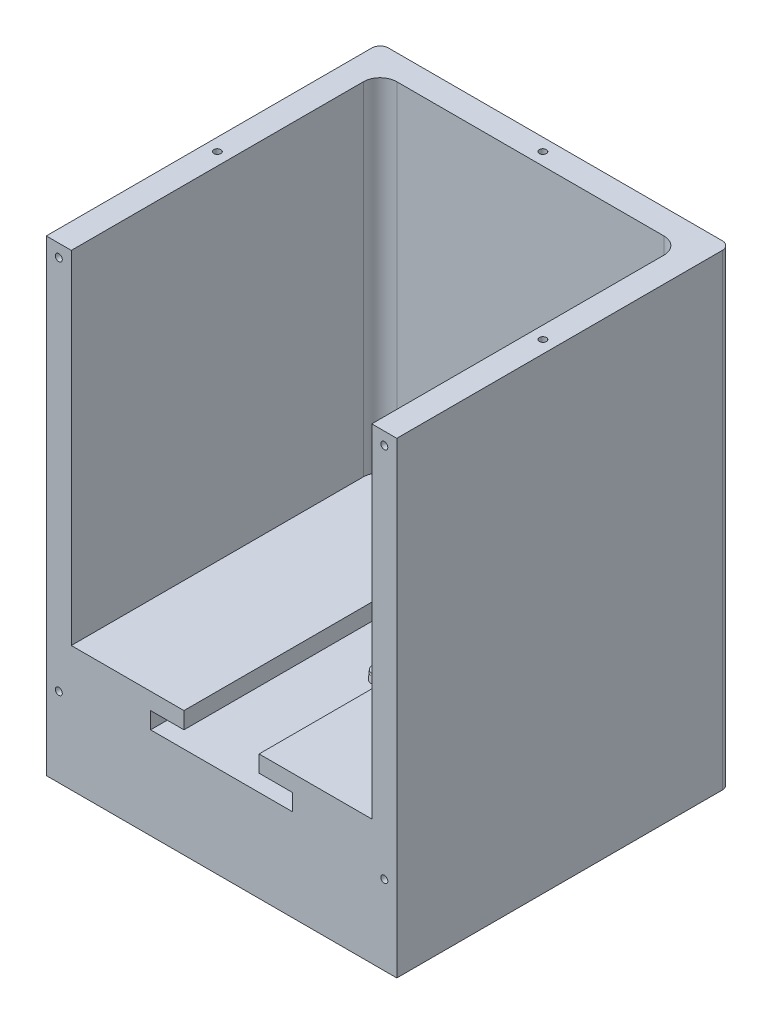
ISO-10303-21;
HEADER;
FILE_DESCRIPTION(('STEP AP214'),'2;1');
FILE_NAME('part.step','',(''),(''),'','','');
FILE_SCHEMA(('AUTOMOTIVE_DESIGN { 1 0 10303 214 1 1 1 1 }'));
ENDSEC;
DATA;
#1=APPLICATION_CONTEXT('core data for automotive mechanical design processes');
#2=APPLICATION_PROTOCOL_DEFINITION('international standard','automotive_design',2000,#1);
#3=PRODUCT_CONTEXT('',#1,'mechanical');
#4=PRODUCT('Part','Part','',(#3));
#5=PRODUCT_RELATED_PRODUCT_CATEGORY('part','',(#4));
#6=PRODUCT_DEFINITION_FORMATION('','',#4);
#7=PRODUCT_DEFINITION_CONTEXT('part definition',#1,'design');
#8=PRODUCT_DEFINITION('design','',#6,#7);
#9=PRODUCT_DEFINITION_SHAPE('','',#8);
#10=(LENGTH_UNIT() NAMED_UNIT(*) SI_UNIT(.MILLI.,.METRE.));
#11=(NAMED_UNIT(*) PLANE_ANGLE_UNIT() SI_UNIT($,.RADIAN.));
#12=(NAMED_UNIT(*) SI_UNIT($,.STERADIAN.) SOLID_ANGLE_UNIT());
#13=UNCERTAINTY_MEASURE_WITH_UNIT(LENGTH_MEASURE(1.E-05),#10,'distance_accuracy_value','');
#14=(GEOMETRIC_REPRESENTATION_CONTEXT(3) GLOBAL_UNCERTAINTY_ASSIGNED_CONTEXT((#13)) GLOBAL_UNIT_ASSIGNED_CONTEXT((#10,
#11,#12)) REPRESENTATION_CONTEXT('',''));
#15=CARTESIAN_POINT('',(0.,0.,0.));
#16=DIRECTION('',(0.,0.,1.));
#17=DIRECTION('',(1.,0.,0.));
#18=AXIS2_PLACEMENT_3D('',#15,#16,#17);
#19=CARTESIAN_POINT('',(-105.,225.,-15.));
#20=DIRECTION('',(0.,0.,1.));
#21=DIRECTION('',(1.,0.,0.));
#22=AXIS2_PLACEMENT_3D('',#19,#20,#21);
#23=PLANE('',#22);
#24=DIRECTION('',(1.,0.,0.));
#25=VECTOR('',#24,1.);
#26=CARTESIAN_POINT('',(0.,-55.,-15.));
#27=LINE('',#26,#25);
#28=CARTESIAN_POINT('',(-99.9999999999999,-55.,-15.));
#29=VERTEX_POINT('',#28);
#30=CARTESIAN_POINT('',(99.9999999999999,-55.,-15.));
#31=VERTEX_POINT('',#30);
#32=EDGE_CURVE('E290',#29,#31,#27,.T.);
#33=ORIENTED_EDGE('',*,*,#32,.F.);
#34=DIRECTION('',(0.,-1.,0.));
#35=VECTOR('',#34,1.);
#36=CARTESIAN_POINT('',(-99.9999999999999,225.,-15.));
#37=LINE('',#36,#35);
#38=CARTESIAN_POINT('',(-99.9999999999999,225.,-15.));
#39=VERTEX_POINT('',#38);
#40=EDGE_CURVE('E71',#29,#39,#37,.F.);
#41=ORIENTED_EDGE('',*,*,#40,.T.);
#42=DIRECTION('',(-1.,0.,0.));
#43=VECTOR('',#42,1.);
#44=CARTESIAN_POINT('',(-105.,225.,-15.));
#45=LINE('',#44,#43);
#46=CARTESIAN_POINT('',(99.9999999999999,225.,-15.));
#47=VERTEX_POINT('',#46);
#48=EDGE_CURVE('E415',#47,#39,#45,.T.);
#49=ORIENTED_EDGE('',*,*,#48,.F.);
#50=DIRECTION('',(0.,-1.,0.));
#51=VECTOR('',#50,1.);
#52=CARTESIAN_POINT('',(99.9999999999999,225.,-15.));
#53=LINE('',#52,#51);
#54=EDGE_CURVE('E482',#47,#31,#53,.T.);
#55=ORIENTED_EDGE('',*,*,#54,.T.);
#56=EDGE_LOOP('',(#33,#41,#49,#55));
#57=FACE_BOUND('',#56,.T.);
#58=DIRECTION('',(-1.,0.,0.));
#59=VECTOR('',#58,1.);
#60=CARTESIAN_POINT('',(0.,10.25,-15.));
#61=LINE('',#60,#59);
#62=CARTESIAN_POINT('',(42.5,10.25,-15.));
#63=VERTEX_POINT('',#62);
#64=CARTESIAN_POINT('',(21.5,10.25,-15.));
#65=VERTEX_POINT('',#64);
#66=EDGE_CURVE('E216',#63,#65,#61,.T.);
#67=ORIENTED_EDGE('',*,*,#66,.T.);
#68=DIRECTION('',(0.,-1.,0.));
#69=VECTOR('',#68,1.);
#70=CARTESIAN_POINT('',(21.5,0.,-15.));
#71=LINE('',#70,#69);
#72=CARTESIAN_POINT('',(21.5,0.,-15.));
#73=VERTEX_POINT('',#72);
#74=EDGE_CURVE('E227',#65,#73,#71,.T.);
#75=ORIENTED_EDGE('',*,*,#74,.T.);
#76=DIRECTION('',(-1.,0.,0.));
#77=VECTOR('',#76,1.);
#78=CARTESIAN_POINT('',(0.,0.,-15.));
#79=LINE('',#78,#77);
#80=CARTESIAN_POINT('',(42.5,0.,-15.));
#81=VERTEX_POINT('',#80);
#82=EDGE_CURVE('E223',#81,#73,#79,.T.);
#83=ORIENTED_EDGE('',*,*,#82,.F.);
#84=DIRECTION('',(0.,-1.,0.));
#85=VECTOR('',#84,1.);
#86=CARTESIAN_POINT('',(42.5,0.,-15.));
#87=LINE('',#86,#85);
#88=EDGE_CURVE('E237',#63,#81,#87,.T.);
#89=ORIENTED_EDGE('',*,*,#88,.F.);
#90=EDGE_LOOP('',(#67,#75,#83,#89));
#91=FACE_BOUND('',#90,.T.);
#92=ADVANCED_FACE('F49',(#57,#91),#23,.F.);
#93=CARTESIAN_POINT('',(-90.,225.,185.));
#94=DIRECTION('',(0.,0.,-1.));
#95=DIRECTION('',(-1.,0.,0.));
#96=AXIS2_PLACEMENT_3D('',#93,#94,#95);
#97=PLANE('',#96);
#98=DIRECTION('',(0.,-1.,0.));
#99=VECTOR('',#98,1.);
#100=CARTESIAN_POINT('',(-42.5,10.,185.));
#101=LINE('',#100,#99);
#102=CARTESIAN_POINT('',(-42.5,10.,185.));
#103=VERTEX_POINT('',#102);
#104=CARTESIAN_POINT('',(-42.5,0.,185.));
#105=VERTEX_POINT('',#104);
#106=EDGE_CURVE('E264',#103,#105,#101,.T.);
#107=ORIENTED_EDGE('',*,*,#106,.F.);
#108=DIRECTION('',(1.,0.,0.));
#109=VECTOR('',#108,1.);
#110=CARTESIAN_POINT('',(-90.,10.,185.));
#111=LINE('',#110,#109);
#112=CARTESIAN_POINT('',(-22.5,10.,185.));
#113=VERTEX_POINT('',#112);
#114=EDGE_CURVE('E333',#103,#113,#111,.T.);
#115=ORIENTED_EDGE('',*,*,#114,.T.);
#116=DIRECTION('',(0.,-1.,0.));
#117=VECTOR('',#116,1.);
#118=CARTESIAN_POINT('',(-22.5,20.,185.));
#119=LINE('',#118,#117);
#120=CARTESIAN_POINT('',(-22.5,20.,185.));
#121=VERTEX_POINT('',#120);
#122=EDGE_CURVE('E393',#121,#113,#119,.T.);
#123=ORIENTED_EDGE('',*,*,#122,.F.);
#124=DIRECTION('',(1.,0.,0.));
#125=VECTOR('',#124,1.);
#126=CARTESIAN_POINT('',(-90.,20.,185.));
#127=LINE('',#126,#125);
#128=CARTESIAN_POINT('',(-90.,20.,185.));
#129=VERTEX_POINT('',#128);
#130=EDGE_CURVE('E337',#129,#121,#127,.T.);
#131=ORIENTED_EDGE('',*,*,#130,.F.);
#132=DIRECTION('',(0.,-1.,0.));
#133=VECTOR('',#132,1.);
#134=CARTESIAN_POINT('',(-90.,225.,185.));
#135=LINE('',#134,#133);
#136=CARTESIAN_POINT('',(-90.,225.,185.));
#137=VERTEX_POINT('',#136);
#138=EDGE_CURVE('E424',#137,#129,#135,.T.);
#139=ORIENTED_EDGE('',*,*,#138,.F.);
#140=DIRECTION('',(1.,0.,0.));
#141=VECTOR('',#140,1.);
#142=CARTESIAN_POINT('',(-90.,225.,185.));
#143=LINE('',#142,#141);
#144=CARTESIAN_POINT('',(-105.,225.,185.));
#145=VERTEX_POINT('',#144);
#146=EDGE_CURVE('E421',#145,#137,#143,.T.);
#147=ORIENTED_EDGE('',*,*,#146,.F.);
#148=DIRECTION('',(0.,-1.,0.));
#149=VECTOR('',#148,1.);
#150=CARTESIAN_POINT('',(-105.,225.,185.));
#151=LINE('',#150,#149);
#152=CARTESIAN_POINT('',(-105.,-55.,185.));
#153=VERTEX_POINT('',#152);
#154=EDGE_CURVE('E431',#145,#153,#151,.T.);
#155=ORIENTED_EDGE('',*,*,#154,.T.);
#156=DIRECTION('',(-1.,0.,0.));
#157=VECTOR('',#156,1.);
#158=CARTESIAN_POINT('',(0.,-55.,185.));
#159=LINE('',#158,#157);
#160=CARTESIAN_POINT('',(105.,-55.,185.));
#161=VERTEX_POINT('',#160);
#162=EDGE_CURVE('E282',#161,#153,#159,.T.);
#163=ORIENTED_EDGE('',*,*,#162,.F.);
#164=DIRECTION('',(0.,-1.,0.));
#165=VECTOR('',#164,1.);
#166=CARTESIAN_POINT('',(105.,225.,185.));
#167=LINE('',#166,#165);
#168=CARTESIAN_POINT('',(105.,225.,185.));
#169=VERTEX_POINT('',#168);
#170=EDGE_CURVE('E434',#169,#161,#167,.T.);
#171=ORIENTED_EDGE('',*,*,#170,.F.);
#172=DIRECTION('',(1.,0.,0.));
#173=VECTOR('',#172,1.);
#174=CARTESIAN_POINT('',(105.,225.,185.));
#175=LINE('',#174,#173);
#176=CARTESIAN_POINT('',(90.,225.,185.));
#177=VERTEX_POINT('',#176);
#178=EDGE_CURVE('E409',#177,#169,#175,.T.);
#179=ORIENTED_EDGE('',*,*,#178,.F.);
#180=DIRECTION('',(0.,-1.,0.));
#181=VECTOR('',#180,1.);
#182=CARTESIAN_POINT('',(90.,225.,185.));
#183=LINE('',#182,#181);
#184=CARTESIAN_POINT('',(90.,20.,185.));
#185=VERTEX_POINT('',#184);
#186=EDGE_CURVE('E438',#177,#185,#183,.T.);
#187=ORIENTED_EDGE('',*,*,#186,.T.);
#188=DIRECTION('',(1.,0.,0.));
#189=VECTOR('',#188,1.);
#190=CARTESIAN_POINT('',(22.5,20.,185.));
#191=LINE('',#190,#189);
#192=CARTESIAN_POINT('',(22.5,20.,185.));
#193=VERTEX_POINT('',#192);
#194=EDGE_CURVE('E350',#193,#185,#191,.T.);
#195=ORIENTED_EDGE('',*,*,#194,.F.);
#196=DIRECTION('',(0.,-1.,0.));
#197=VECTOR('',#196,1.);
#198=CARTESIAN_POINT('',(22.5,20.,185.));
#199=LINE('',#198,#197);
#200=CARTESIAN_POINT('',(22.5,10.,185.));
#201=VERTEX_POINT('',#200);
#202=EDGE_CURVE('E362',#193,#201,#199,.T.);
#203=ORIENTED_EDGE('',*,*,#202,.T.);
#204=DIRECTION('',(1.,0.,0.));
#205=VECTOR('',#204,1.);
#206=CARTESIAN_POINT('',(22.5,10.,185.));
#207=LINE('',#206,#205);
#208=CARTESIAN_POINT('',(42.5,10.,185.));
#209=VERTEX_POINT('',#208);
#210=EDGE_CURVE('E374',#201,#209,#207,.T.);
#211=ORIENTED_EDGE('',*,*,#210,.T.);
#212=DIRECTION('',(0.,1.,0.));
#213=VECTOR('',#212,1.);
#214=CARTESIAN_POINT('',(42.5,0.,185.));
#215=LINE('',#214,#213);
#216=CARTESIAN_POINT('',(42.5,0.,185.));
#217=VERTEX_POINT('',#216);
#218=EDGE_CURVE('E271',#217,#209,#215,.T.);
#219=ORIENTED_EDGE('',*,*,#218,.F.);
#220=DIRECTION('',(-1.,0.,0.));
#221=VECTOR('',#220,1.);
#222=CARTESIAN_POINT('',(-105.,0.,185.));
#223=LINE('',#222,#221);
#224=EDGE_CURVE('E326',#217,#105,#223,.T.);
#225=ORIENTED_EDGE('',*,*,#224,.T.);
#226=EDGE_LOOP('',(#107,#115,#123,#131,#139,#147,#155,#163,#171,#179,#187,#195,#203,#211,#219,#225));
#227=FACE_BOUND('',#226,.T.);
#228=CARTESIAN_POINT('',(-97.4999999999999,217.5,185.));
#229=DIRECTION('',(0.,0.,1.));
#230=DIRECTION('',(1.,0.,0.));
#231=AXIS2_PLACEMENT_3D('',#228,#229,#230);
#232=CIRCLE('',#231,2.1);
#233=CARTESIAN_POINT('',(-95.3999999999999,217.5,185.));
#234=VERTEX_POINT('',#233);
#235=EDGE_CURVE('E307',#234,#234,#232,.T.);
#236=ORIENTED_EDGE('',*,*,#235,.F.);
#237=EDGE_LOOP('',(#236));
#238=FACE_BOUND('',#237,.T.);
#239=CARTESIAN_POINT('',(-97.4999999999999,-7.50000000000001,185.));
#240=DIRECTION('',(0.,0.,1.));
#241=DIRECTION('',(1.,0.,0.));
#242=AXIS2_PLACEMENT_3D('',#239,#240,#241);
#243=CIRCLE('',#242,2.1);
#244=CARTESIAN_POINT('',(-95.3999999999999,-7.50000000000001,185.));
#245=VERTEX_POINT('',#244);
#246=EDGE_CURVE('E302',#245,#245,#243,.T.);
#247=ORIENTED_EDGE('',*,*,#246,.F.);
#248=EDGE_LOOP('',(#247));
#249=FACE_BOUND('',#248,.T.);
#250=CARTESIAN_POINT('',(97.4999999999999,217.5,185.));
#251=DIRECTION('',(0.,0.,-1.));
#252=DIRECTION('',(-1.,0.,0.));
#253=AXIS2_PLACEMENT_3D('',#250,#251,#252);
#254=CIRCLE('',#253,2.1);
#255=CARTESIAN_POINT('',(95.3999999999999,217.5,185.));
#256=VERTEX_POINT('',#255);
#257=EDGE_CURVE('E298',#256,#256,#254,.T.);
#258=ORIENTED_EDGE('',*,*,#257,.T.);
#259=EDGE_LOOP('',(#258));
#260=FACE_BOUND('',#259,.T.);
#261=CARTESIAN_POINT('',(97.4999999999999,-7.50000000000001,185.));
#262=DIRECTION('',(0.,0.,-1.));
#263=DIRECTION('',(-1.,0.,0.));
#264=AXIS2_PLACEMENT_3D('',#261,#262,#263);
#265=CIRCLE('',#264,2.1);
#266=CARTESIAN_POINT('',(95.3999999999999,-7.50000000000001,185.));
#267=VERTEX_POINT('',#266);
#268=EDGE_CURVE('E315',#267,#267,#265,.T.);
#269=ORIENTED_EDGE('',*,*,#268,.T.);
#270=EDGE_LOOP('',(#269));
#271=FACE_BOUND('',#270,.T.);
#272=ADVANCED_FACE('F514',(#227,#238,#249,#260,#271),#97,.F.);
#273=CARTESIAN_POINT('',(-90.,225.,0.));
#274=DIRECTION('',(-1.,0.,0.));
#275=DIRECTION('',(0.,0.,1.));
#276=AXIS2_PLACEMENT_3D('',#273,#274,#275);
#277=PLANE('',#276);
#278=DIRECTION('',(0.,0.,1.));
#279=VECTOR('',#278,1.);
#280=CARTESIAN_POINT('',(-90.,20.,185.));
#281=LINE('',#280,#279);
#282=CARTESIAN_POINT('',(-90.,20.,10.));
#283=VERTEX_POINT('',#282);
#284=EDGE_CURVE('E334',#283,#129,#281,.T.);
#285=ORIENTED_EDGE('',*,*,#284,.F.);
#286=DIRECTION('',(0.,-1.,0.));
#287=VECTOR('',#286,1.);
#288=CARTESIAN_POINT('',(-90.,225.,10.));
#289=LINE('',#288,#287);
#290=CARTESIAN_POINT('',(-90.,225.,10.));
#291=VERTEX_POINT('',#290);
#292=EDGE_CURVE('E459',#283,#291,#289,.F.);
#293=ORIENTED_EDGE('',*,*,#292,.T.);
#294=DIRECTION('',(0.,0.,-1.));
#295=VECTOR('',#294,1.);
#296=CARTESIAN_POINT('',(-90.,225.,0.));
#297=LINE('',#296,#295);
#298=EDGE_CURVE('E398',#137,#291,#297,.T.);
#299=ORIENTED_EDGE('',*,*,#298,.F.);
#300=ORIENTED_EDGE('',*,*,#138,.T.);
#301=EDGE_LOOP('',(#285,#293,#299,#300));
#302=FACE_BOUND('',#301,.T.);
#303=ADVANCED_FACE('F641',(#302),#277,.F.);
#304=CARTESIAN_POINT('',(-90.,225.,0.));
#305=DIRECTION('',(0.,0.,-1.));
#306=DIRECTION('',(-1.,0.,0.));
#307=AXIS2_PLACEMENT_3D('',#304,#305,#306);
#308=PLANE('',#307);
#309=DIRECTION('',(1.,0.,0.));
#310=VECTOR('',#309,1.);
#311=CARTESIAN_POINT('',(-90.,225.,0.));
#312=LINE('',#311,#310);
#313=CARTESIAN_POINT('',(-80.,225.,0.));
#314=VERTEX_POINT('',#313);
#315=CARTESIAN_POINT('',(79.9999999999999,225.,0.));
#316=VERTEX_POINT('',#315);
#317=EDGE_CURVE('E402',#314,#316,#312,.T.);
#318=ORIENTED_EDGE('',*,*,#317,.F.);
#319=DIRECTION('',(0.,-1.,0.));
#320=VECTOR('',#319,1.);
#321=CARTESIAN_POINT('',(-80.,20.,0.));
#322=LINE('',#321,#320);
#323=CARTESIAN_POINT('',(-80.,20.,0.));
#324=VERTEX_POINT('',#323);
#325=EDGE_CURVE('E449',#314,#324,#322,.T.);
#326=ORIENTED_EDGE('',*,*,#325,.T.);
#327=DIRECTION('',(-1.,0.,0.));
#328=VECTOR('',#327,1.);
#329=CARTESIAN_POINT('',(-90.,20.,0.));
#330=LINE('',#329,#328);
#331=CARTESIAN_POINT('',(79.9999999999999,20.,0.));
#332=VERTEX_POINT('',#331);
#333=EDGE_CURVE('E358',#332,#324,#330,.T.);
#334=ORIENTED_EDGE('',*,*,#333,.F.);
#335=DIRECTION('',(0.,-1.,0.));
#336=VECTOR('',#335,1.);
#337=CARTESIAN_POINT('',(80.,225.,0.));
#338=LINE('',#337,#336);
#339=EDGE_CURVE('E446',#332,#316,#338,.F.);
#340=ORIENTED_EDGE('',*,*,#339,.T.);
#341=EDGE_LOOP('',(#318,#326,#334,#340));
#342=FACE_BOUND('',#341,.T.);
#343=ADVANCED_FACE('F528',(#342),#308,.F.);
#344=CARTESIAN_POINT('',(90.,225.,0.));
#345=DIRECTION('',(1.,0.,0.));
#346=DIRECTION('',(0.,0.,-1.));
#347=AXIS2_PLACEMENT_3D('',#344,#345,#346);
#348=PLANE('',#347);
#349=DIRECTION('',(0.,0.,1.));
#350=VECTOR('',#349,1.);
#351=CARTESIAN_POINT('',(90.,225.,0.));
#352=LINE('',#351,#350);
#353=CARTESIAN_POINT('',(90.,225.,10.));
#354=VERTEX_POINT('',#353);
#355=EDGE_CURVE('E406',#354,#177,#352,.T.);
#356=ORIENTED_EDGE('',*,*,#355,.F.);
#357=DIRECTION('',(0.,-1.,0.));
#358=VECTOR('',#357,1.);
#359=CARTESIAN_POINT('',(90.,20.,10.));
#360=LINE('',#359,#358);
#361=CARTESIAN_POINT('',(90.,20.,10.));
#362=VERTEX_POINT('',#361);
#363=EDGE_CURVE('E462',#354,#362,#360,.T.);
#364=ORIENTED_EDGE('',*,*,#363,.T.);
#365=DIRECTION('',(0.,0.,-1.));
#366=VECTOR('',#365,1.);
#367=CARTESIAN_POINT('',(90.,20.,0.));
#368=LINE('',#367,#366);
#369=EDGE_CURVE('E354',#185,#362,#368,.T.);
#370=ORIENTED_EDGE('',*,*,#369,.F.);
#371=ORIENTED_EDGE('',*,*,#186,.F.);
#372=EDGE_LOOP('',(#356,#364,#370,#371));
#373=FACE_BOUND('',#372,.T.);
#374=ADVANCED_FACE('F539',(#373),#348,.F.);
#375=DIRECTION('',(1.,0.,0.));
#376=VECTOR('',#375,1.);
#377=CARTESIAN_POINT('',(-90.,0.,0.));
#378=LINE('',#377,#376);
#379=CARTESIAN_POINT('',(-42.5,0.,0.));
#380=VERTEX_POINT('',#379);
#381=CARTESIAN_POINT('',(21.5,0.,0.));
#382=VERTEX_POINT('',#381);
#383=EDGE_CURVE('E397',#380,#382,#378,.T.);
#384=ORIENTED_EDGE('',*,*,#383,.T.);
#385=DIRECTION('',(0.,1.,0.));
#386=VECTOR('',#385,1.);
#387=CARTESIAN_POINT('',(21.5,0.,0.));
#388=LINE('',#387,#386);
#389=CARTESIAN_POINT('',(21.4999999999999,10.,0.));
#390=VERTEX_POINT('',#389);
#391=EDGE_CURVE('E257',#382,#390,#388,.T.);
#392=ORIENTED_EDGE('',*,*,#391,.T.);
#393=DIRECTION('',(-1.,0.,0.));
#394=VECTOR('',#393,1.);
#395=CARTESIAN_POINT('',(-90.,10.,0.));
#396=LINE('',#395,#394);
#397=CARTESIAN_POINT('',(-42.5,10.,0.));
#398=VERTEX_POINT('',#397);
#399=EDGE_CURVE('E378',#390,#398,#396,.T.);
#400=ORIENTED_EDGE('',*,*,#399,.T.);
#401=DIRECTION('',(0.,1.,0.));
#402=VECTOR('',#401,1.);
#403=CARTESIAN_POINT('',(-42.5,0.,0.));
#404=LINE('',#403,#402);
#405=EDGE_CURVE('E256',#380,#398,#404,.T.);
#406=ORIENTED_EDGE('',*,*,#405,.F.);
#407=EDGE_LOOP('',(#384,#392,#400,#406));
#408=FACE_BOUND('',#407,.T.);
#409=ADVANCED_FACE('F569',(#408),#308,.F.);
#410=CARTESIAN_POINT('',(105.,225.,-15.));
#411=DIRECTION('',(-1.,0.,0.));
#412=DIRECTION('',(0.,0.,1.));
#413=AXIS2_PLACEMENT_3D('',#410,#411,#412);
#414=PLANE('',#413);
#415=DIRECTION('',(0.,0.,1.));
#416=VECTOR('',#415,1.);
#417=CARTESIAN_POINT('',(105.,-55.,0.));
#418=LINE('',#417,#416);
#419=CARTESIAN_POINT('',(105.,-55.,-9.99999999999998));
#420=VERTEX_POINT('',#419);
#421=EDGE_CURVE('E294',#420,#161,#418,.T.);
#422=ORIENTED_EDGE('',*,*,#421,.F.);
#423=DIRECTION('',(0.,-1.,0.));
#424=VECTOR('',#423,1.);
#425=CARTESIAN_POINT('',(105.,225.,-9.99999999999998));
#426=LINE('',#425,#424);
#427=CARTESIAN_POINT('',(105.,225.,-9.99999999999999));
#428=VERTEX_POINT('',#427);
#429=EDGE_CURVE('E11',#420,#428,#426,.F.);
#430=ORIENTED_EDGE('',*,*,#429,.T.);
#431=DIRECTION('',(0.,0.,-1.));
#432=VECTOR('',#431,1.);
#433=CARTESIAN_POINT('',(105.,225.,-15.));
#434=LINE('',#433,#432);
#435=EDGE_CURVE('E412',#169,#428,#434,.T.);
#436=ORIENTED_EDGE('',*,*,#435,.F.);
#437=ORIENTED_EDGE('',*,*,#170,.T.);
#438=EDGE_LOOP('',(#422,#430,#436,#437));
#439=FACE_BOUND('',#438,.T.);
#440=ADVANCED_FACE('F508',(#439),#414,.F.);
#441=CARTESIAN_POINT('',(-105.,225.,185.));
#442=DIRECTION('',(1.,0.,0.));
#443=DIRECTION('',(0.,0.,-1.));
#444=AXIS2_PLACEMENT_3D('',#441,#442,#443);
#445=PLANE('',#444);
#446=DIRECTION('',(0.,0.,1.));
#447=VECTOR('',#446,1.);
#448=CARTESIAN_POINT('',(-105.,225.,185.));
#449=LINE('',#448,#447);
#450=CARTESIAN_POINT('',(-105.,225.,-9.99999999999993));
#451=VERTEX_POINT('',#450);
#452=EDGE_CURVE('E418',#451,#145,#449,.T.);
#453=ORIENTED_EDGE('',*,*,#452,.F.);
#454=DIRECTION('',(0.,-1.,0.));
#455=VECTOR('',#454,1.);
#456=CARTESIAN_POINT('',(-105.,225.,-9.99999999999998));
#457=LINE('',#456,#455);
#458=CARTESIAN_POINT('',(-105.,-55.,-9.99999999999998));
#459=VERTEX_POINT('',#458);
#460=EDGE_CURVE('E472',#451,#459,#457,.T.);
#461=ORIENTED_EDGE('',*,*,#460,.T.);
#462=DIRECTION('',(0.,0.,-1.));
#463=VECTOR('',#462,1.);
#464=CARTESIAN_POINT('',(-105.,-55.,0.));
#465=LINE('',#464,#463);
#466=EDGE_CURVE('E286',#153,#459,#465,.T.);
#467=ORIENTED_EDGE('',*,*,#466,.F.);
#468=ORIENTED_EDGE('',*,*,#154,.F.);
#469=EDGE_LOOP('',(#453,#461,#467,#468));
#470=FACE_BOUND('',#469,.T.);
#471=ADVANCED_FACE('F499',(#470),#445,.F.);
#472=CARTESIAN_POINT('',(0.,225.,0.));
#473=DIRECTION('',(0.,-1.,0.));
#474=DIRECTION('',(0.,0.,-1.));
#475=AXIS2_PLACEMENT_3D('',#472,#473,#474);
#476=PLANE('',#475);
#477=CARTESIAN_POINT('',(0.,225.,-7.50000000000006));
#478=DIRECTION('',(0.,1.,0.));
#479=DIRECTION('',(0.,0.,1.));
#480=AXIS2_PLACEMENT_3D('',#477,#478,#479);
#481=CIRCLE('',#480,2.1);
#482=CARTESIAN_POINT('',(0.,225.,-5.40000000000006));
#483=VERTEX_POINT('',#482);
#484=EDGE_CURVE('E594',#483,#483,#481,.T.);
#485=ORIENTED_EDGE('',*,*,#484,.F.);
#486=EDGE_LOOP('',(#485));
#487=FACE_BOUND('',#486,.T.);
#488=CARTESIAN_POINT('',(-97.4999999999999,225.,90.));
#489=DIRECTION('',(0.,1.,0.));
#490=DIRECTION('',(0.,0.,1.));
#491=AXIS2_PLACEMENT_3D('',#488,#489,#490);
#492=CIRCLE('',#491,2.1);
#493=CARTESIAN_POINT('',(-97.4999999999999,225.,92.1));
#494=VERTEX_POINT('',#493);
#495=EDGE_CURVE('E590',#494,#494,#492,.T.);
#496=ORIENTED_EDGE('',*,*,#495,.F.);
#497=EDGE_LOOP('',(#496));
#498=FACE_BOUND('',#497,.T.);
#499=CARTESIAN_POINT('',(97.4999999999999,225.,90.));
#500=DIRECTION('',(0.,1.,0.));
#501=DIRECTION('',(0.,0.,-1.));
#502=AXIS2_PLACEMENT_3D('',#499,#500,#501);
#503=CIRCLE('',#502,2.09999999999987);
#504=CARTESIAN_POINT('',(97.4999999999999,225.,87.9000000000001));
#505=VERTEX_POINT('',#504);
#506=EDGE_CURVE('E582',#505,#505,#503,.T.);
#507=ORIENTED_EDGE('',*,*,#506,.F.);
#508=EDGE_LOOP('',(#507));
#509=FACE_BOUND('',#508,.T.);
#510=ORIENTED_EDGE('',*,*,#48,.T.);
#511=CARTESIAN_POINT('',(-99.9999999999999,225.,-9.99999999999998));
#512=DIRECTION('',(0.,-1.,0.));
#513=DIRECTION('',(0.,0.,-1.));
#514=AXIS2_PLACEMENT_3D('',#511,#512,#513);
#515=CIRCLE('',#514,5.);
#516=EDGE_CURVE('E58',#39,#451,#515,.F.);
#517=ORIENTED_EDGE('',*,*,#516,.T.);
#518=ORIENTED_EDGE('',*,*,#452,.T.);
#519=ORIENTED_EDGE('',*,*,#146,.T.);
#520=ORIENTED_EDGE('',*,*,#298,.T.);
#521=CARTESIAN_POINT('',(-80.,225.,10.));
#522=DIRECTION('',(0.,-1.,0.));
#523=DIRECTION('',(0.,0.,-1.));
#524=AXIS2_PLACEMENT_3D('',#521,#522,#523);
#525=CIRCLE('',#524,10.);
#526=EDGE_CURVE('E466',#291,#314,#525,.T.);
#527=ORIENTED_EDGE('',*,*,#526,.T.);
#528=ORIENTED_EDGE('',*,*,#317,.T.);
#529=CARTESIAN_POINT('',(80.,225.,10.));
#530=DIRECTION('',(0.,-1.,0.));
#531=DIRECTION('',(0.,0.,-1.));
#532=AXIS2_PLACEMENT_3D('',#529,#530,#531);
#533=CIRCLE('',#532,10.);
#534=EDGE_CURVE('E469',#316,#354,#533,.T.);
#535=ORIENTED_EDGE('',*,*,#534,.T.);
#536=ORIENTED_EDGE('',*,*,#355,.T.);
#537=ORIENTED_EDGE('',*,*,#178,.T.);
#538=ORIENTED_EDGE('',*,*,#435,.T.);
#539=CARTESIAN_POINT('',(99.9999999999999,225.,-9.99999999999998));
#540=DIRECTION('',(0.,-1.,0.));
#541=DIRECTION('',(0.,0.,-1.));
#542=AXIS2_PLACEMENT_3D('',#539,#540,#541);
#543=CIRCLE('',#542,5.);
#544=EDGE_CURVE('E488',#428,#47,#543,.F.);
#545=ORIENTED_EDGE('',*,*,#544,.T.);
#546=EDGE_LOOP('',(#510,#517,#518,#519,#520,#527,#528,#535,#536,#537,#538,#545));
#547=FACE_BOUND('',#546,.T.);
#548=ADVANCED_FACE('F494',(#487,#498,#509,#547),#476,.F.);
#549=CARTESIAN_POINT('',(-22.5,20.,185.));
#550=DIRECTION('',(-1.,0.,0.));
#551=DIRECTION('',(0.,0.,1.));
#552=AXIS2_PLACEMENT_3D('',#549,#550,#551);
#553=PLANE('',#552);
#554=DIRECTION('',(0.,0.,-1.));
#555=VECTOR('',#554,1.);
#556=CARTESIAN_POINT('',(-22.5,10.,185.));
#557=LINE('',#556,#555);
#558=CARTESIAN_POINT('',(-22.5,10.,10.));
#559=VERTEX_POINT('',#558);
#560=EDGE_CURVE('E365',#113,#559,#557,.T.);
#561=ORIENTED_EDGE('',*,*,#560,.T.);
#562=DIRECTION('',(0.,-1.,0.));
#563=VECTOR('',#562,1.);
#564=CARTESIAN_POINT('',(-22.5,20.,10.));
#565=LINE('',#564,#563);
#566=CARTESIAN_POINT('',(-22.5,20.,10.));
#567=VERTEX_POINT('',#566);
#568=EDGE_CURVE('E389',#567,#559,#565,.T.);
#569=ORIENTED_EDGE('',*,*,#568,.F.);
#570=DIRECTION('',(0.,0.,-1.));
#571=VECTOR('',#570,1.);
#572=CARTESIAN_POINT('',(-22.5,20.,185.));
#573=LINE('',#572,#571);
#574=EDGE_CURVE('E341',#121,#567,#573,.T.);
#575=ORIENTED_EDGE('',*,*,#574,.F.);
#576=ORIENTED_EDGE('',*,*,#122,.T.);
#577=EDGE_LOOP('',(#561,#569,#575,#576));
#578=FACE_BOUND('',#577,.T.);
#579=ADVANCED_FACE('F613',(#578),#553,.F.);
#580=CARTESIAN_POINT('',(-22.5,20.,10.));
#581=DIRECTION('',(0.,0.,-1.));
#582=DIRECTION('',(-1.,0.,0.));
#583=AXIS2_PLACEMENT_3D('',#580,#581,#582);
#584=PLANE('',#583);
#585=DIRECTION('',(1.,0.,0.));
#586=VECTOR('',#585,1.);
#587=CARTESIAN_POINT('',(-22.5,10.,10.));
#588=LINE('',#587,#586);
#589=CARTESIAN_POINT('',(22.4999999999999,10.,10.));
#590=VERTEX_POINT('',#589);
#591=EDGE_CURVE('E368',#559,#590,#588,.T.);
#592=ORIENTED_EDGE('',*,*,#591,.T.);
#593=DIRECTION('',(0.,-1.,0.));
#594=VECTOR('',#593,1.);
#595=CARTESIAN_POINT('',(22.4999999999999,20.,10.));
#596=LINE('',#595,#594);
#597=CARTESIAN_POINT('',(22.4999999999999,20.,10.));
#598=VERTEX_POINT('',#597);
#599=EDGE_CURVE('E385',#598,#590,#596,.T.);
#600=ORIENTED_EDGE('',*,*,#599,.F.);
#601=DIRECTION('',(1.,0.,0.));
#602=VECTOR('',#601,1.);
#603=CARTESIAN_POINT('',(-22.5,20.,10.));
#604=LINE('',#603,#602);
#605=EDGE_CURVE('E344',#567,#598,#604,.T.);
#606=ORIENTED_EDGE('',*,*,#605,.F.);
#607=ORIENTED_EDGE('',*,*,#568,.T.);
#608=EDGE_LOOP('',(#592,#600,#606,#607));
#609=FACE_BOUND('',#608,.T.);
#610=ADVANCED_FACE('F913',(#609),#584,.F.);
#611=CARTESIAN_POINT('',(22.4999999999999,20.,10.));
#612=DIRECTION('',(1.,0.,0.));
#613=DIRECTION('',(0.,0.,-1.));
#614=AXIS2_PLACEMENT_3D('',#611,#612,#613);
#615=PLANE('',#614);
#616=DIRECTION('',(0.,0.,1.));
#617=VECTOR('',#616,1.);
#618=CARTESIAN_POINT('',(22.4999999999999,10.,10.));
#619=LINE('',#618,#617);
#620=EDGE_CURVE('E371',#590,#201,#619,.T.);
#621=ORIENTED_EDGE('',*,*,#620,.T.);
#622=ORIENTED_EDGE('',*,*,#202,.F.);
#623=DIRECTION('',(0.,0.,1.));
#624=VECTOR('',#623,1.);
#625=CARTESIAN_POINT('',(22.4999999999999,20.,10.));
#626=LINE('',#625,#624);
#627=EDGE_CURVE('E347',#598,#193,#626,.T.);
#628=ORIENTED_EDGE('',*,*,#627,.F.);
#629=ORIENTED_EDGE('',*,*,#599,.T.);
#630=EDGE_LOOP('',(#621,#622,#628,#629));
#631=FACE_BOUND('',#630,.T.);
#632=ADVANCED_FACE('F547',(#631),#615,.F.);
#633=CARTESIAN_POINT('',(0.,20.,0.));
#634=DIRECTION('',(0.,-1.,0.));
#635=DIRECTION('',(0.,0.,-1.));
#636=AXIS2_PLACEMENT_3D('',#633,#634,#635);
#637=PLANE('',#636);
#638=ORIENTED_EDGE('',*,*,#333,.T.);
#639=CARTESIAN_POINT('',(-80.,20.,10.));
#640=DIRECTION('',(0.,-1.,0.));
#641=DIRECTION('',(0.,0.,-1.));
#642=AXIS2_PLACEMENT_3D('',#639,#640,#641);
#643=CIRCLE('',#642,10.);
#644=EDGE_CURVE('E456',#324,#283,#643,.F.);
#645=ORIENTED_EDGE('',*,*,#644,.T.);
#646=ORIENTED_EDGE('',*,*,#284,.T.);
#647=ORIENTED_EDGE('',*,*,#130,.T.);
#648=ORIENTED_EDGE('',*,*,#574,.T.);
#649=ORIENTED_EDGE('',*,*,#605,.T.);
#650=ORIENTED_EDGE('',*,*,#627,.T.);
#651=ORIENTED_EDGE('',*,*,#194,.T.);
#652=ORIENTED_EDGE('',*,*,#369,.T.);
#653=CARTESIAN_POINT('',(80.,20.,10.));
#654=DIRECTION('',(0.,-1.,0.));
#655=DIRECTION('',(0.,0.,-1.));
#656=AXIS2_PLACEMENT_3D('',#653,#654,#655);
#657=CIRCLE('',#656,10.);
#658=EDGE_CURVE('E453',#362,#332,#657,.F.);
#659=ORIENTED_EDGE('',*,*,#658,.T.);
#660=EDGE_LOOP('',(#638,#645,#646,#647,#648,#649,#650,#651,#652,#659));
#661=FACE_BOUND('',#660,.T.);
#662=ADVANCED_FACE('F531',(#661),#637,.F.);
#663=CARTESIAN_POINT('',(0.,10.,0.));
#664=DIRECTION('',(0.,-1.,0.));
#665=DIRECTION('',(0.,0.,-1.));
#666=AXIS2_PLACEMENT_3D('',#663,#664,#665);
#667=PLANE('',#666);
#668=DIRECTION('',(0.,0.,1.));
#669=VECTOR('',#668,1.);
#670=CARTESIAN_POINT('',(-42.5,10.,0.));
#671=LINE('',#670,#669);
#672=EDGE_CURVE('E261',#398,#103,#671,.T.);
#673=ORIENTED_EDGE('',*,*,#672,.F.);
#674=ORIENTED_EDGE('',*,*,#399,.F.);
#675=CARTESIAN_POINT('',(42.5,10.,0.));
#676=VERTEX_POINT('',#675);
#677=EDGE_CURVE('E338',#676,#390,#396,.T.);
#678=ORIENTED_EDGE('',*,*,#677,.F.);
#679=DIRECTION('',(0.,0.,-1.));
#680=VECTOR('',#679,1.);
#681=CARTESIAN_POINT('',(42.5,10.,185.));
#682=LINE('',#681,#680);
#683=EDGE_CURVE('E274',#209,#676,#682,.T.);
#684=ORIENTED_EDGE('',*,*,#683,.F.);
#685=ORIENTED_EDGE('',*,*,#210,.F.);
#686=ORIENTED_EDGE('',*,*,#620,.F.);
#687=ORIENTED_EDGE('',*,*,#591,.F.);
#688=ORIENTED_EDGE('',*,*,#560,.F.);
#689=ORIENTED_EDGE('',*,*,#114,.F.);
#690=EDGE_LOOP('',(#673,#674,#678,#684,#685,#686,#687,#688,#689));
#691=FACE_BOUND('',#690,.T.);
#692=ADVANCED_FACE('F553',(#691),#667,.T.);
#693=CARTESIAN_POINT('',(0.,0.,0.));
#694=DIRECTION('',(0.,-1.,0.));
#695=DIRECTION('',(0.,0.,-1.));
#696=AXIS2_PLACEMENT_3D('',#693,#694,#695);
#697=PLANE('',#696);
#698=CARTESIAN_POINT('',(0.,0.,90.));
#699=DIRECTION('',(0.,-1.,0.));
#700=DIRECTION('',(0.,0.,-1.));
#701=AXIS2_PLACEMENT_3D('',#698,#699,#700);
#702=CIRCLE('',#701,5.00000000000001);
#703=CARTESIAN_POINT('',(0.,0.,85.));
#704=VERTEX_POINT('',#703);
#705=EDGE_CURVE('E442',#704,#704,#702,.F.);
#706=ORIENTED_EDGE('',*,*,#705,.F.);
#707=EDGE_LOOP('',(#706));
#708=FACE_BOUND('',#707,.T.);
#709=ORIENTED_EDGE('',*,*,#383,.F.);
#710=DIRECTION('',(0.,0.,-1.));
#711=VECTOR('',#710,1.);
#712=CARTESIAN_POINT('',(-42.5,0.,185.));
#713=LINE('',#712,#711);
#714=EDGE_CURVE('E253',#105,#380,#713,.T.);
#715=ORIENTED_EDGE('',*,*,#714,.F.);
#716=ORIENTED_EDGE('',*,*,#224,.F.);
#717=DIRECTION('',(0.,0.,1.));
#718=VECTOR('',#717,1.);
#719=CARTESIAN_POINT('',(42.5,0.,0.));
#720=LINE('',#719,#718);
#721=EDGE_CURVE('E267',#81,#217,#720,.T.);
#722=ORIENTED_EDGE('',*,*,#721,.F.);
#723=ORIENTED_EDGE('',*,*,#82,.T.);
#724=DIRECTION('',(0.,0.,-1.));
#725=VECTOR('',#724,1.);
#726=CARTESIAN_POINT('',(21.5,0.,23.3679802293651));
#727=LINE('',#726,#725);
#728=EDGE_CURVE('E230',#382,#73,#727,.T.);
#729=ORIENTED_EDGE('',*,*,#728,.F.);
#730=EDGE_LOOP('',(#709,#715,#716,#722,#723,#729));
#731=FACE_BOUND('',#730,.T.);
#732=ADVANCED_FACE('F564',(#708,#731),#697,.F.);
#733=CARTESIAN_POINT('',(-97.4999999999999,-7.50000000000001,180.5));
#734=DIRECTION('',(0.,0.,1.));
#735=DIRECTION('',(1.,0.,0.));
#736=AXIS2_PLACEMENT_3D('',#733,#734,#735);
#737=CYLINDRICAL_SURFACE('',#736,2.1);
#738=CARTESIAN_POINT('',(-97.4999999999999,-7.50000000000001,180.5));
#739=DIRECTION('',(0.,0.,1.));
#740=DIRECTION('',(1.,0.,0.));
#741=AXIS2_PLACEMENT_3D('',#738,#739,#740);
#742=CIRCLE('',#741,2.1);
#743=CARTESIAN_POINT('',(-95.3999999999999,-7.50000000000001,180.5));
#744=VERTEX_POINT('',#743);
#745=EDGE_CURVE('E322',#744,#744,#742,.T.);
#746=ORIENTED_EDGE('',*,*,#745,.F.);
#747=EDGE_LOOP('',(#746));
#748=FACE_BOUND('',#747,.T.);
#749=ORIENTED_EDGE('',*,*,#246,.T.);
#750=EDGE_LOOP('',(#749));
#751=FACE_BOUND('',#750,.T.);
#752=ADVANCED_FACE('F766',(#748,#751),#737,.F.);
#753=CARTESIAN_POINT('',(-97.4999999999999,-7.50000000000001,180.5));
#754=DIRECTION('',(0.,0.,1.));
#755=DIRECTION('',(1.,0.,0.));
#756=AXIS2_PLACEMENT_3D('',#753,#754,#755);
#757=PLANE('',#756);
#758=ORIENTED_EDGE('',*,*,#745,.T.);
#759=EDGE_LOOP('',(#758));
#760=FACE_BOUND('',#759,.T.);
#761=ADVANCED_FACE('F868',(#760),#757,.T.);
#762=CARTESIAN_POINT('',(97.4999999999999,217.5,180.5));
#763=DIRECTION('',(0.,0.,1.));
#764=DIRECTION('',(1.,0.,0.));
#765=AXIS2_PLACEMENT_3D('',#762,#763,#764);
#766=CYLINDRICAL_SURFACE('',#765,2.1);
#767=CARTESIAN_POINT('',(97.4999999999999,217.5,180.5));
#768=DIRECTION('',(0.,0.,-1.));
#769=DIRECTION('',(-1.,0.,0.));
#770=AXIS2_PLACEMENT_3D('',#767,#768,#769);
#771=CIRCLE('',#770,2.1);
#772=CARTESIAN_POINT('',(95.3999999999999,217.5,180.5));
#773=VERTEX_POINT('',#772);
#774=EDGE_CURVE('E303',#773,#773,#771,.T.);
#775=ORIENTED_EDGE('',*,*,#774,.T.);
#776=EDGE_LOOP('',(#775));
#777=FACE_BOUND('',#776,.T.);
#778=ORIENTED_EDGE('',*,*,#257,.F.);
#779=EDGE_LOOP('',(#778));
#780=FACE_BOUND('',#779,.T.);
#781=ADVANCED_FACE('F859',(#777,#780),#766,.F.);
#782=CARTESIAN_POINT('',(97.4999999999999,217.5,180.5));
#783=DIRECTION('',(0.,0.,-1.));
#784=DIRECTION('',(-1.,0.,0.));
#785=AXIS2_PLACEMENT_3D('',#782,#783,#784);
#786=PLANE('',#785);
#787=ORIENTED_EDGE('',*,*,#774,.F.);
#788=EDGE_LOOP('',(#787));
#789=FACE_BOUND('',#788,.T.);
#790=ADVANCED_FACE('F850',(#789),#786,.F.);
#791=CARTESIAN_POINT('',(-97.4999999999999,217.5,180.5));
#792=DIRECTION('',(0.,0.,1.));
#793=DIRECTION('',(1.,0.,0.));
#794=AXIS2_PLACEMENT_3D('',#791,#792,#793);
#795=CYLINDRICAL_SURFACE('',#794,2.1);
#796=CARTESIAN_POINT('',(-97.4999999999999,217.5,180.5));
#797=DIRECTION('',(0.,0.,1.));
#798=DIRECTION('',(1.,0.,0.));
#799=AXIS2_PLACEMENT_3D('',#796,#797,#798);
#800=CIRCLE('',#799,2.1);
#801=CARTESIAN_POINT('',(-95.3999999999999,217.5,180.5));
#802=VERTEX_POINT('',#801);
#803=EDGE_CURVE('E311',#802,#802,#800,.T.);
#804=ORIENTED_EDGE('',*,*,#803,.F.);
#805=EDGE_LOOP('',(#804));
#806=FACE_BOUND('',#805,.T.);
#807=ORIENTED_EDGE('',*,*,#235,.T.);
#808=EDGE_LOOP('',(#807));
#809=FACE_BOUND('',#808,.T.);
#810=ADVANCED_FACE('F841',(#806,#809),#795,.F.);
#811=CARTESIAN_POINT('',(-97.4999999999999,217.5,180.5));
#812=DIRECTION('',(0.,0.,1.));
#813=DIRECTION('',(1.,0.,0.));
#814=AXIS2_PLACEMENT_3D('',#811,#812,#813);
#815=PLANE('',#814);
#816=ORIENTED_EDGE('',*,*,#803,.T.);
#817=EDGE_LOOP('',(#816));
#818=FACE_BOUND('',#817,.T.);
#819=ADVANCED_FACE('F832',(#818),#815,.T.);
#820=CARTESIAN_POINT('',(97.4999999999999,-7.50000000000001,180.5));
#821=DIRECTION('',(0.,0.,1.));
#822=DIRECTION('',(1.,0.,0.));
#823=AXIS2_PLACEMENT_3D('',#820,#821,#822);
#824=CYLINDRICAL_SURFACE('',#823,2.1);
#825=CARTESIAN_POINT('',(97.4999999999999,-7.50000000000001,180.5));
#826=DIRECTION('',(0.,0.,-1.));
#827=DIRECTION('',(-1.,0.,0.));
#828=AXIS2_PLACEMENT_3D('',#825,#826,#827);
#829=CIRCLE('',#828,2.1);
#830=CARTESIAN_POINT('',(95.3999999999999,-7.50000000000001,180.5));
#831=VERTEX_POINT('',#830);
#832=EDGE_CURVE('E297',#831,#831,#829,.T.);
#833=ORIENTED_EDGE('',*,*,#832,.T.);
#834=EDGE_LOOP('',(#833));
#835=FACE_BOUND('',#834,.T.);
#836=ORIENTED_EDGE('',*,*,#268,.F.);
#837=EDGE_LOOP('',(#836));
#838=FACE_BOUND('',#837,.T.);
#839=ADVANCED_FACE('F822',(#835,#838),#824,.F.);
#840=CARTESIAN_POINT('',(97.4999999999999,-7.50000000000001,180.5));
#841=DIRECTION('',(0.,0.,-1.));
#842=DIRECTION('',(-1.,0.,0.));
#843=AXIS2_PLACEMENT_3D('',#840,#841,#842);
#844=PLANE('',#843);
#845=ORIENTED_EDGE('',*,*,#832,.F.);
#846=EDGE_LOOP('',(#845));
#847=FACE_BOUND('',#846,.T.);
#848=ADVANCED_FACE('F813',(#847),#844,.F.);
#849=CARTESIAN_POINT('',(0.,-55.,0.));
#850=DIRECTION('',(0.,-1.,0.));
#851=DIRECTION('',(0.,0.,-1.));
#852=AXIS2_PLACEMENT_3D('',#849,#850,#851);
#853=PLANE('',#852);
#854=ORIENTED_EDGE('',*,*,#466,.T.);
#855=CARTESIAN_POINT('',(-99.9999999999999,-55.,-9.99999999999998));
#856=DIRECTION('',(0.,-1.,0.));
#857=DIRECTION('',(0.,0.,-1.));
#858=AXIS2_PLACEMENT_3D('',#855,#856,#857);
#859=CIRCLE('',#858,5.);
#860=EDGE_CURVE('E479',#459,#29,#859,.T.);
#861=ORIENTED_EDGE('',*,*,#860,.T.);
#862=ORIENTED_EDGE('',*,*,#32,.T.);
#863=CARTESIAN_POINT('',(99.9999999999999,-55.,-9.99999999999998));
#864=DIRECTION('',(0.,-1.,0.));
#865=DIRECTION('',(0.,0.,-1.));
#866=AXIS2_PLACEMENT_3D('',#863,#864,#865);
#867=CIRCLE('',#866,5.);
#868=EDGE_CURVE('E476',#31,#420,#867,.T.);
#869=ORIENTED_EDGE('',*,*,#868,.T.);
#870=ORIENTED_EDGE('',*,*,#421,.T.);
#871=ORIENTED_EDGE('',*,*,#162,.T.);
#872=EDGE_LOOP('',(#854,#861,#862,#869,#870,#871));
#873=FACE_BOUND('',#872,.T.);
#874=ADVANCED_FACE('F504',(#873),#853,.T.);
#875=CARTESIAN_POINT('',(0.,0.,90.));
#876=DIRECTION('',(0.,-1.,0.));
#877=DIRECTION('',(0.,0.,1.));
#878=AXIS2_PLACEMENT_3D('',#875,#876,#877);
#879=CONICAL_SURFACE('',#878,5.00000000000001,0.0872664625997167);
#880=CARTESIAN_POINT('',(0.,5.,90.));
#881=DIRECTION('',(0.,1.,0.));
#882=DIRECTION('',(0.,0.,1.));
#883=AXIS2_PLACEMENT_3D('',#880,#881,#882);
#884=CIRCLE('',#883,4.56255668237039);
#885=CARTESIAN_POINT('',(0.,5.,94.5625566823704));
#886=VERTEX_POINT('',#885);
#887=EDGE_CURVE('E278',#886,#886,#884,.T.);
#888=ORIENTED_EDGE('',*,*,#887,.F.);
#889=EDGE_LOOP('',(#888));
#890=FACE_BOUND('',#889,.T.);
#891=ORIENTED_EDGE('',*,*,#705,.T.);
#892=EDGE_LOOP('',(#891));
#893=FACE_BOUND('',#892,.T.);
#894=ADVANCED_FACE('F797',(#890,#893),#879,.T.);
#895=CARTESIAN_POINT('',(0.,5.,90.));
#896=DIRECTION('',(0.,1.,0.));
#897=DIRECTION('',(0.,0.,1.));
#898=AXIS2_PLACEMENT_3D('',#895,#896,#897);
#899=PLANE('',#898);
#900=ORIENTED_EDGE('',*,*,#887,.T.);
#901=EDGE_LOOP('',(#900));
#902=FACE_BOUND('',#901,.T.);
#903=ADVANCED_FACE('F753',(#902),#899,.T.);
#904=CARTESIAN_POINT('',(42.5,0.,0.));
#905=DIRECTION('',(-1.,0.,0.));
#906=DIRECTION('',(0.,0.,1.));
#907=AXIS2_PLACEMENT_3D('',#904,#905,#906);
#908=PLANE('',#907);
#909=ORIENTED_EDGE('',*,*,#721,.T.);
#910=ORIENTED_EDGE('',*,*,#218,.T.);
#911=ORIENTED_EDGE('',*,*,#683,.T.);
#912=DIRECTION('',(0.,1.,0.));
#913=VECTOR('',#912,1.);
#914=CARTESIAN_POINT('',(42.5,0.,0.));
#915=LINE('',#914,#913);
#916=CARTESIAN_POINT('',(42.5,10.25,0.));
#917=VERTEX_POINT('',#916);
#918=EDGE_CURVE('E252',#676,#917,#915,.T.);
#919=ORIENTED_EDGE('',*,*,#918,.T.);
#920=DIRECTION('',(0.,0.,-1.));
#921=VECTOR('',#920,1.);
#922=CARTESIAN_POINT('',(42.5,10.25,23.3679802293651));
#923=LINE('',#922,#921);
#924=EDGE_CURVE('E222',#917,#63,#923,.T.);
#925=ORIENTED_EDGE('',*,*,#924,.T.);
#926=ORIENTED_EDGE('',*,*,#88,.T.);
#927=EDGE_LOOP('',(#909,#910,#911,#919,#925,#926));
#928=FACE_BOUND('',#927,.T.);
#929=ADVANCED_FACE('F558',(#928),#908,.T.);
#930=CARTESIAN_POINT('',(-42.5,0.,0.));
#931=DIRECTION('',(1.,0.,0.));
#932=DIRECTION('',(0.,0.,-1.));
#933=AXIS2_PLACEMENT_3D('',#930,#931,#932);
#934=PLANE('',#933);
#935=ORIENTED_EDGE('',*,*,#714,.T.);
#936=ORIENTED_EDGE('',*,*,#405,.T.);
#937=ORIENTED_EDGE('',*,*,#672,.T.);
#938=ORIENTED_EDGE('',*,*,#106,.T.);
#939=EDGE_LOOP('',(#935,#936,#937,#938));
#940=FACE_BOUND('',#939,.T.);
#941=ADVANCED_FACE('F567',(#940),#934,.T.);
#942=CARTESIAN_POINT('',(-90.,225.,0.));
#943=DIRECTION('',(0.,0.,-1.));
#944=DIRECTION('',(-1.,0.,0.));
#945=AXIS2_PLACEMENT_3D('',#942,#943,#944);
#946=PLANE('',#945);
#947=ORIENTED_EDGE('',*,*,#677,.T.);
#948=CARTESIAN_POINT('',(21.5,10.25,0.));
#949=VERTEX_POINT('',#948);
#950=EDGE_CURVE('E574',#390,#949,#388,.T.);
#951=ORIENTED_EDGE('',*,*,#950,.T.);
#952=DIRECTION('',(1.,0.,0.));
#953=VECTOR('',#952,1.);
#954=CARTESIAN_POINT('',(0.,10.25,0.));
#955=LINE('',#954,#953);
#956=EDGE_CURVE('E219',#949,#917,#955,.T.);
#957=ORIENTED_EDGE('',*,*,#956,.T.);
#958=ORIENTED_EDGE('',*,*,#918,.F.);
#959=EDGE_LOOP('',(#947,#951,#957,#958));
#960=FACE_BOUND('',#959,.T.);
#961=ADVANCED_FACE('F735',(#960),#946,.T.);
#962=CARTESIAN_POINT('',(0.,10.25,23.3679802293651));
#963=DIRECTION('',(0.,-1.,0.));
#964=DIRECTION('',(0.,0.,-1.));
#965=AXIS2_PLACEMENT_3D('',#962,#963,#964);
#966=PLANE('',#965);
#967=DIRECTION('',(0.,0.,-1.));
#968=VECTOR('',#967,1.);
#969=CARTESIAN_POINT('',(21.5,10.25,23.3679802293651));
#970=LINE('',#969,#968);
#971=EDGE_CURVE('E211',#949,#65,#970,.T.);
#972=ORIENTED_EDGE('',*,*,#971,.T.);
#973=ORIENTED_EDGE('',*,*,#66,.F.);
#974=ORIENTED_EDGE('',*,*,#924,.F.);
#975=ORIENTED_EDGE('',*,*,#956,.F.);
#976=EDGE_LOOP('',(#972,#973,#974,#975));
#977=FACE_BOUND('',#976,.T.);
#978=ADVANCED_FACE('F213',(#977),#966,.T.);
#979=CARTESIAN_POINT('',(21.5,0.,23.3679802293651));
#980=DIRECTION('',(1.,0.,0.));
#981=DIRECTION('',(0.,0.,-1.));
#982=AXIS2_PLACEMENT_3D('',#979,#980,#981);
#983=PLANE('',#982);
#984=ORIENTED_EDGE('',*,*,#728,.T.);
#985=ORIENTED_EDGE('',*,*,#74,.F.);
#986=ORIENTED_EDGE('',*,*,#971,.F.);
#987=ORIENTED_EDGE('',*,*,#950,.F.);
#988=ORIENTED_EDGE('',*,*,#391,.F.);
#989=EDGE_LOOP('',(#984,#985,#986,#987,#988));
#990=FACE_BOUND('',#989,.T.);
#991=ADVANCED_FACE('F228',(#990),#983,.T.);
#992=CARTESIAN_POINT('',(97.4999999999999,220.5,90.));
#993=DIRECTION('',(0.,1.,0.));
#994=DIRECTION('',(0.,0.,1.));
#995=AXIS2_PLACEMENT_3D('',#992,#993,#994);
#996=CYLINDRICAL_SURFACE('',#995,2.09999999999987);
#997=CARTESIAN_POINT('',(97.4999999999999,220.5,90.));
#998=DIRECTION('',(0.,1.,0.));
#999=DIRECTION('',(0.,0.,-1.));
#1000=AXIS2_PLACEMENT_3D('',#997,#998,#999);
#1001=CIRCLE('',#1000,2.09999999999987);
#1002=CARTESIAN_POINT('',(97.4999999999999,220.5,87.9000000000001));
#1003=VERTEX_POINT('',#1002);
#1004=EDGE_CURVE('E578',#1003,#1003,#1001,.T.);
#1005=ORIENTED_EDGE('',*,*,#1004,.F.);
#1006=EDGE_LOOP('',(#1005));
#1007=FACE_BOUND('',#1006,.T.);
#1008=ORIENTED_EDGE('',*,*,#506,.T.);
#1009=EDGE_LOOP('',(#1008));
#1010=FACE_BOUND('',#1009,.T.);
#1011=ADVANCED_FACE('F619',(#1007,#1010),#996,.F.);
#1012=CARTESIAN_POINT('',(97.4999999999999,220.5,90.));
#1013=DIRECTION('',(0.,-1.,0.));
#1014=DIRECTION('',(0.,0.,-1.));
#1015=AXIS2_PLACEMENT_3D('',#1012,#1013,#1014);
#1016=PLANE('',#1015);
#1017=ORIENTED_EDGE('',*,*,#1004,.T.);
#1018=EDGE_LOOP('',(#1017));
#1019=FACE_BOUND('',#1018,.T.);
#1020=ADVANCED_FACE('F621',(#1019),#1016,.F.);
#1021=CARTESIAN_POINT('',(-97.4999999999999,220.5,90.));
#1022=DIRECTION('',(0.,1.,0.));
#1023=DIRECTION('',(0.,0.,1.));
#1024=AXIS2_PLACEMENT_3D('',#1021,#1022,#1023);
#1025=CYLINDRICAL_SURFACE('',#1024,2.1);
#1026=CARTESIAN_POINT('',(-97.4999999999999,220.5,90.));
#1027=DIRECTION('',(0.,1.,0.));
#1028=DIRECTION('',(0.,0.,1.));
#1029=AXIS2_PLACEMENT_3D('',#1026,#1027,#1028);
#1030=CIRCLE('',#1029,2.1);
#1031=CARTESIAN_POINT('',(-97.4999999999999,220.5,92.1));
#1032=VERTEX_POINT('',#1031);
#1033=EDGE_CURVE('E586',#1032,#1032,#1030,.T.);
#1034=ORIENTED_EDGE('',*,*,#1033,.F.);
#1035=EDGE_LOOP('',(#1034));
#1036=FACE_BOUND('',#1035,.T.);
#1037=ORIENTED_EDGE('',*,*,#495,.T.);
#1038=EDGE_LOOP('',(#1037));
#1039=FACE_BOUND('',#1038,.T.);
#1040=ADVANCED_FACE('F628',(#1036,#1039),#1025,.F.);
#1041=CARTESIAN_POINT('',(-97.4999999999999,220.5,90.));
#1042=DIRECTION('',(0.,1.,0.));
#1043=DIRECTION('',(0.,0.,1.));
#1044=AXIS2_PLACEMENT_3D('',#1041,#1042,#1043);
#1045=PLANE('',#1044);
#1046=ORIENTED_EDGE('',*,*,#1033,.T.);
#1047=EDGE_LOOP('',(#1046));
#1048=FACE_BOUND('',#1047,.T.);
#1049=ADVANCED_FACE('F607',(#1048),#1045,.T.);
#1050=CARTESIAN_POINT('',(0.,220.5,-7.50000000000006));
#1051=DIRECTION('',(0.,1.,0.));
#1052=DIRECTION('',(0.,0.,1.));
#1053=AXIS2_PLACEMENT_3D('',#1050,#1051,#1052);
#1054=CYLINDRICAL_SURFACE('',#1053,2.1);
#1055=CARTESIAN_POINT('',(0.,220.5,-7.50000000000006));
#1056=DIRECTION('',(0.,1.,0.));
#1057=DIRECTION('',(0.,0.,1.));
#1058=AXIS2_PLACEMENT_3D('',#1055,#1056,#1057);
#1059=CIRCLE('',#1058,2.1);
#1060=CARTESIAN_POINT('',(0.,220.5,-5.40000000000006));
#1061=VERTEX_POINT('',#1060);
#1062=EDGE_CURVE('E234',#1061,#1061,#1059,.T.);
#1063=ORIENTED_EDGE('',*,*,#1062,.F.);
#1064=EDGE_LOOP('',(#1063));
#1065=FACE_BOUND('',#1064,.T.);
#1066=ORIENTED_EDGE('',*,*,#484,.T.);
#1067=EDGE_LOOP('',(#1066));
#1068=FACE_BOUND('',#1067,.T.);
#1069=ADVANCED_FACE('F604',(#1065,#1068),#1054,.F.);
#1070=CARTESIAN_POINT('',(0.,220.5,-7.50000000000006));
#1071=DIRECTION('',(0.,1.,0.));
#1072=DIRECTION('',(0.,0.,1.));
#1073=AXIS2_PLACEMENT_3D('',#1070,#1071,#1072);
#1074=PLANE('',#1073);
#1075=ORIENTED_EDGE('',*,*,#1062,.T.);
#1076=EDGE_LOOP('',(#1075));
#1077=FACE_BOUND('',#1076,.T.);
#1078=ADVANCED_FACE('F602',(#1077),#1074,.T.);
#1079=CARTESIAN_POINT('',(-80.,225.,10.));
#1080=DIRECTION('',(0.,1.,0.));
#1081=DIRECTION('',(0.,0.,1.));
#1082=AXIS2_PLACEMENT_3D('',#1079,#1080,#1081);
#1083=CYLINDRICAL_SURFACE('',#1082,10.);
#1084=ORIENTED_EDGE('',*,*,#526,.F.);
#1085=ORIENTED_EDGE('',*,*,#292,.F.);
#1086=ORIENTED_EDGE('',*,*,#644,.F.);
#1087=ORIENTED_EDGE('',*,*,#325,.F.);
#1088=EDGE_LOOP('',(#1084,#1085,#1086,#1087));
#1089=FACE_BOUND('',#1088,.T.);
#1090=ADVANCED_FACE('F525',(#1089),#1083,.F.);
#1091=CARTESIAN_POINT('',(80.,225.,10.));
#1092=DIRECTION('',(0.,1.,0.));
#1093=DIRECTION('',(0.,0.,1.));
#1094=AXIS2_PLACEMENT_3D('',#1091,#1092,#1093);
#1095=CYLINDRICAL_SURFACE('',#1094,10.);
#1096=ORIENTED_EDGE('',*,*,#534,.F.);
#1097=ORIENTED_EDGE('',*,*,#339,.F.);
#1098=ORIENTED_EDGE('',*,*,#658,.F.);
#1099=ORIENTED_EDGE('',*,*,#363,.F.);
#1100=EDGE_LOOP('',(#1096,#1097,#1098,#1099));
#1101=FACE_BOUND('',#1100,.T.);
#1102=ADVANCED_FACE('F536',(#1101),#1095,.F.);
#1103=CARTESIAN_POINT('',(-99.9999999999999,225.,-9.99999999999998));
#1104=DIRECTION('',(0.,-1.,0.));
#1105=DIRECTION('',(0.,0.,-1.));
#1106=AXIS2_PLACEMENT_3D('',#1103,#1104,#1105);
#1107=CYLINDRICAL_SURFACE('',#1106,5.);
#1108=ORIENTED_EDGE('',*,*,#516,.F.);
#1109=ORIENTED_EDGE('',*,*,#40,.F.);
#1110=ORIENTED_EDGE('',*,*,#860,.F.);
#1111=ORIENTED_EDGE('',*,*,#460,.F.);
#1112=EDGE_LOOP('',(#1108,#1109,#1110,#1111));
#1113=FACE_BOUND('',#1112,.T.);
#1114=ADVANCED_FACE('F502',(#1113),#1107,.T.);
#1115=CARTESIAN_POINT('',(99.9999999999999,225.,-9.99999999999998));
#1116=DIRECTION('',(0.,-1.,0.));
#1117=DIRECTION('',(0.,0.,-1.));
#1118=AXIS2_PLACEMENT_3D('',#1115,#1116,#1117);
#1119=CYLINDRICAL_SURFACE('',#1118,5.);
#1120=ORIENTED_EDGE('',*,*,#544,.F.);
#1121=ORIENTED_EDGE('',*,*,#429,.F.);
#1122=ORIENTED_EDGE('',*,*,#868,.F.);
#1123=ORIENTED_EDGE('',*,*,#54,.F.);
#1124=EDGE_LOOP('',(#1120,#1121,#1122,#1123));
#1125=FACE_BOUND('',#1124,.T.);
#1126=ADVANCED_FACE('F51',(#1125),#1119,.T.);
#1127=CLOSED_SHELL('',(#92,#272,#303,#343,#374,#409,#440,#471,#548,#579,#610,#632,#662,#692,
#732,#752,#761,#781,#790,#810,#819,#839,#848,#874,#894,#903,#929,#941,#961,#978,#991,#1011,
#1020,#1040,#1049,#1069,#1078,#1090,#1102,#1114,#1126));
#1128=MANIFOLD_SOLID_BREP('B2',#1127);
#1129=ADVANCED_BREP_SHAPE_REPRESENTATION('',(#18,#1128),#14);
#1130=SHAPE_DEFINITION_REPRESENTATION(#9,#1129);
ENDSEC;
END-ISO-10303-21;
